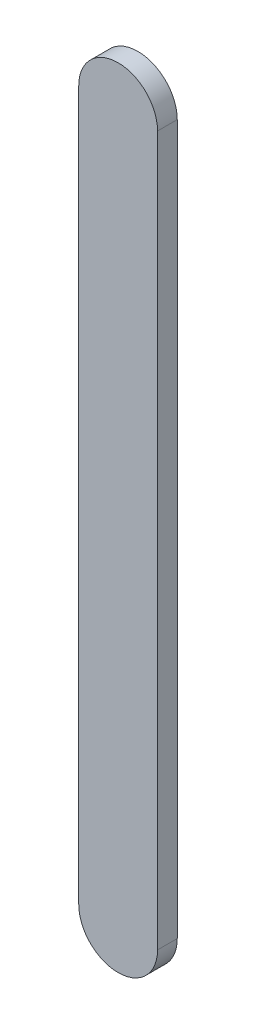
ISO-10303-21;
HEADER;
FILE_DESCRIPTION(('STEP AP214'),'2;1');
FILE_NAME('part.step','',(''),(''),'','','');
FILE_SCHEMA(('AUTOMOTIVE_DESIGN { 1 0 10303 214 1 1 1 1 }'));
ENDSEC;
DATA;
#1=APPLICATION_CONTEXT('core data for automotive mechanical design processes');
#2=APPLICATION_PROTOCOL_DEFINITION('international standard','automotive_design',2000,#1);
#3=PRODUCT_CONTEXT('',#1,'mechanical');
#4=PRODUCT('Part','Part','',(#3));
#5=PRODUCT_RELATED_PRODUCT_CATEGORY('part','',(#4));
#6=PRODUCT_DEFINITION_FORMATION('','',#4);
#7=PRODUCT_DEFINITION_CONTEXT('part definition',#1,'design');
#8=PRODUCT_DEFINITION('design','',#6,#7);
#9=PRODUCT_DEFINITION_SHAPE('','',#8);
#10=(LENGTH_UNIT() NAMED_UNIT(*) SI_UNIT(.MILLI.,.METRE.));
#11=(NAMED_UNIT(*) PLANE_ANGLE_UNIT() SI_UNIT($,.RADIAN.));
#12=(NAMED_UNIT(*) SI_UNIT($,.STERADIAN.) SOLID_ANGLE_UNIT());
#13=UNCERTAINTY_MEASURE_WITH_UNIT(LENGTH_MEASURE(1.E-05),#10,'distance_accuracy_value','');
#14=(GEOMETRIC_REPRESENTATION_CONTEXT(3) GLOBAL_UNCERTAINTY_ASSIGNED_CONTEXT((#13)) GLOBAL_UNIT_ASSIGNED_CONTEXT((#10,
#11,#12)) REPRESENTATION_CONTEXT('',''));
#15=CARTESIAN_POINT('',(0.,0.,0.));
#16=DIRECTION('',(0.,0.,1.));
#17=DIRECTION('',(1.,0.,0.));
#18=AXIS2_PLACEMENT_3D('',#15,#16,#17);
#19=CARTESIAN_POINT('',(0.,0.,5.));
#20=DIRECTION('',(0.,0.,-1.));
#21=DIRECTION('',(-1.,0.,0.));
#22=AXIS2_PLACEMENT_3D('',#19,#20,#21);
#23=CYLINDRICAL_SURFACE('',#22,10.);
#24=CARTESIAN_POINT('',(0.,0.,0.));
#25=DIRECTION('',(0.,0.,1.));
#26=DIRECTION('',(1.,0.,0.));
#27=AXIS2_PLACEMENT_3D('',#24,#25,#26);
#28=CIRCLE('',#27,10.);
#29=CARTESIAN_POINT('',(10.,0.,0.));
#30=VERTEX_POINT('',#29);
#31=CARTESIAN_POINT('',(-10.,0.,0.));
#32=VERTEX_POINT('',#31);
#33=EDGE_CURVE('E107',#30,#32,#28,.T.);
#34=ORIENTED_EDGE('',*,*,#33,.T.);
#35=DIRECTION('',(0.,0.,-1.));
#36=VECTOR('',#35,1.);
#37=CARTESIAN_POINT('',(-10.,0.,5.));
#38=LINE('',#37,#36);
#39=CARTESIAN_POINT('',(-10.,0.,5.));
#40=VERTEX_POINT('',#39);
#41=EDGE_CURVE('E11',#40,#32,#38,.T.);
#42=ORIENTED_EDGE('',*,*,#41,.F.);
#43=CARTESIAN_POINT('',(0.,0.,5.));
#44=DIRECTION('',(0.,0.,1.));
#45=DIRECTION('',(1.,0.,0.));
#46=AXIS2_PLACEMENT_3D('',#43,#44,#45);
#47=CIRCLE('',#46,10.);
#48=CARTESIAN_POINT('',(10.,0.,5.));
#49=VERTEX_POINT('',#48);
#50=EDGE_CURVE('E91',#49,#40,#47,.T.);
#51=ORIENTED_EDGE('',*,*,#50,.F.);
#52=DIRECTION('',(0.,0.,-1.));
#53=VECTOR('',#52,1.);
#54=CARTESIAN_POINT('',(10.,0.,5.));
#55=LINE('',#54,#53);
#56=EDGE_CURVE('E103',#49,#30,#55,.T.);
#57=ORIENTED_EDGE('',*,*,#56,.T.);
#58=EDGE_LOOP('',(#34,#42,#51,#57));
#59=FACE_BOUND('',#58,.T.);
#60=ADVANCED_FACE('F39',(#59),#23,.T.);
#61=CARTESIAN_POINT('',(-10.,0.,5.));
#62=DIRECTION('',(1.,0.,0.));
#63=DIRECTION('',(0.,1.,0.));
#64=AXIS2_PLACEMENT_3D('',#61,#62,#63);
#65=PLANE('',#64);
#66=DIRECTION('',(0.,-1.,0.));
#67=VECTOR('',#66,1.);
#68=CARTESIAN_POINT('',(-10.,0.,0.));
#69=LINE('',#68,#67);
#70=CARTESIAN_POINT('',(-9.99999999999998,-180.,0.));
#71=VERTEX_POINT('',#70);
#72=EDGE_CURVE('E96',#32,#71,#69,.T.);
#73=ORIENTED_EDGE('',*,*,#72,.T.);
#74=DIRECTION('',(0.,0.,-1.));
#75=VECTOR('',#74,1.);
#76=CARTESIAN_POINT('',(-9.99999999999998,-180.,5.));
#77=LINE('',#76,#75);
#78=CARTESIAN_POINT('',(-9.99999999999998,-180.,5.));
#79=VERTEX_POINT('',#78);
#80=EDGE_CURVE('E48',#79,#71,#77,.T.);
#81=ORIENTED_EDGE('',*,*,#80,.F.);
#82=DIRECTION('',(0.,-1.,0.));
#83=VECTOR('',#82,1.);
#84=CARTESIAN_POINT('',(-10.,0.,5.));
#85=LINE('',#84,#83);
#86=EDGE_CURVE('E86',#40,#79,#85,.T.);
#87=ORIENTED_EDGE('',*,*,#86,.F.);
#88=ORIENTED_EDGE('',*,*,#41,.T.);
#89=EDGE_LOOP('',(#73,#81,#87,#88));
#90=FACE_BOUND('',#89,.T.);
#91=ADVANCED_FACE('F95',(#90),#65,.F.);
#92=CARTESIAN_POINT('',(0.,-180.,5.));
#93=DIRECTION('',(0.,0.,-1.));
#94=DIRECTION('',(-1.,0.,0.));
#95=AXIS2_PLACEMENT_3D('',#92,#93,#94);
#96=CYLINDRICAL_SURFACE('',#95,10.);
#97=CARTESIAN_POINT('',(0.,-180.,0.));
#98=DIRECTION('',(0.,0.,1.));
#99=DIRECTION('',(1.,0.,0.));
#100=AXIS2_PLACEMENT_3D('',#97,#98,#99);
#101=CIRCLE('',#100,10.);
#102=CARTESIAN_POINT('',(10.,-180.,0.));
#103=VERTEX_POINT('',#102);
#104=EDGE_CURVE('E73',#71,#103,#101,.T.);
#105=ORIENTED_EDGE('',*,*,#104,.T.);
#106=DIRECTION('',(0.,0.,-1.));
#107=VECTOR('',#106,1.);
#108=CARTESIAN_POINT('',(10.,-180.,5.));
#109=LINE('',#108,#107);
#110=CARTESIAN_POINT('',(10.,-180.,5.));
#111=VERTEX_POINT('',#110);
#112=EDGE_CURVE('E98',#111,#103,#109,.T.);
#113=ORIENTED_EDGE('',*,*,#112,.F.);
#114=CARTESIAN_POINT('',(0.,-180.,5.));
#115=DIRECTION('',(0.,0.,1.));
#116=DIRECTION('',(1.,0.,0.));
#117=AXIS2_PLACEMENT_3D('',#114,#115,#116);
#118=CIRCLE('',#117,10.);
#119=EDGE_CURVE('E89',#79,#111,#118,.T.);
#120=ORIENTED_EDGE('',*,*,#119,.F.);
#121=ORIENTED_EDGE('',*,*,#80,.T.);
#122=EDGE_LOOP('',(#105,#113,#120,#121));
#123=FACE_BOUND('',#122,.T.);
#124=ADVANCED_FACE('F99',(#123),#96,.T.);
#125=CARTESIAN_POINT('',(10.,0.,5.));
#126=DIRECTION('',(-1.,0.,0.));
#127=DIRECTION('',(0.,-1.,0.));
#128=AXIS2_PLACEMENT_3D('',#125,#126,#127);
#129=PLANE('',#128);
#130=DIRECTION('',(0.,1.,0.));
#131=VECTOR('',#130,1.);
#132=CARTESIAN_POINT('',(10.,0.,0.));
#133=LINE('',#132,#131);
#134=EDGE_CURVE('E79',#103,#30,#133,.T.);
#135=ORIENTED_EDGE('',*,*,#134,.T.);
#136=ORIENTED_EDGE('',*,*,#56,.F.);
#137=DIRECTION('',(0.,1.,0.));
#138=VECTOR('',#137,1.);
#139=CARTESIAN_POINT('',(10.,0.,5.));
#140=LINE('',#139,#138);
#141=EDGE_CURVE('E56',#111,#49,#140,.T.);
#142=ORIENTED_EDGE('',*,*,#141,.F.);
#143=ORIENTED_EDGE('',*,*,#112,.T.);
#144=EDGE_LOOP('',(#135,#136,#142,#143));
#145=FACE_BOUND('',#144,.T.);
#146=ADVANCED_FACE('F120',(#145),#129,.F.);
#147=CARTESIAN_POINT('',(0.,0.,5.));
#148=DIRECTION('',(0.,0.,1.));
#149=DIRECTION('',(1.,0.,0.));
#150=AXIS2_PLACEMENT_3D('',#147,#148,#149);
#151=PLANE('',#150);
#152=ORIENTED_EDGE('',*,*,#50,.T.);
#153=ORIENTED_EDGE('',*,*,#86,.T.);
#154=ORIENTED_EDGE('',*,*,#119,.T.);
#155=ORIENTED_EDGE('',*,*,#141,.T.);
#156=EDGE_LOOP('',(#152,#153,#154,#155));
#157=FACE_BOUND('',#156,.T.);
#158=ADVANCED_FACE('F87',(#157),#151,.T.);
#159=CARTESIAN_POINT('',(0.,0.,0.));
#160=DIRECTION('',(0.,0.,1.));
#161=DIRECTION('',(1.,0.,0.));
#162=AXIS2_PLACEMENT_3D('',#159,#160,#161);
#163=PLANE('',#162);
#164=ORIENTED_EDGE('',*,*,#33,.F.);
#165=ORIENTED_EDGE('',*,*,#134,.F.);
#166=ORIENTED_EDGE('',*,*,#104,.F.);
#167=ORIENTED_EDGE('',*,*,#72,.F.);
#168=EDGE_LOOP('',(#164,#165,#166,#167));
#169=FACE_BOUND('',#168,.T.);
#170=ADVANCED_FACE('F123',(#169),#163,.F.);
#171=CLOSED_SHELL('',(#60,#91,#124,#146,#158,#170));
#172=MANIFOLD_SOLID_BREP('B2',#171);
#173=ADVANCED_BREP_SHAPE_REPRESENTATION('',(#18,#172),#14);
#174=SHAPE_DEFINITION_REPRESENTATION(#9,#173);
ENDSEC;
END-ISO-10303-21;
